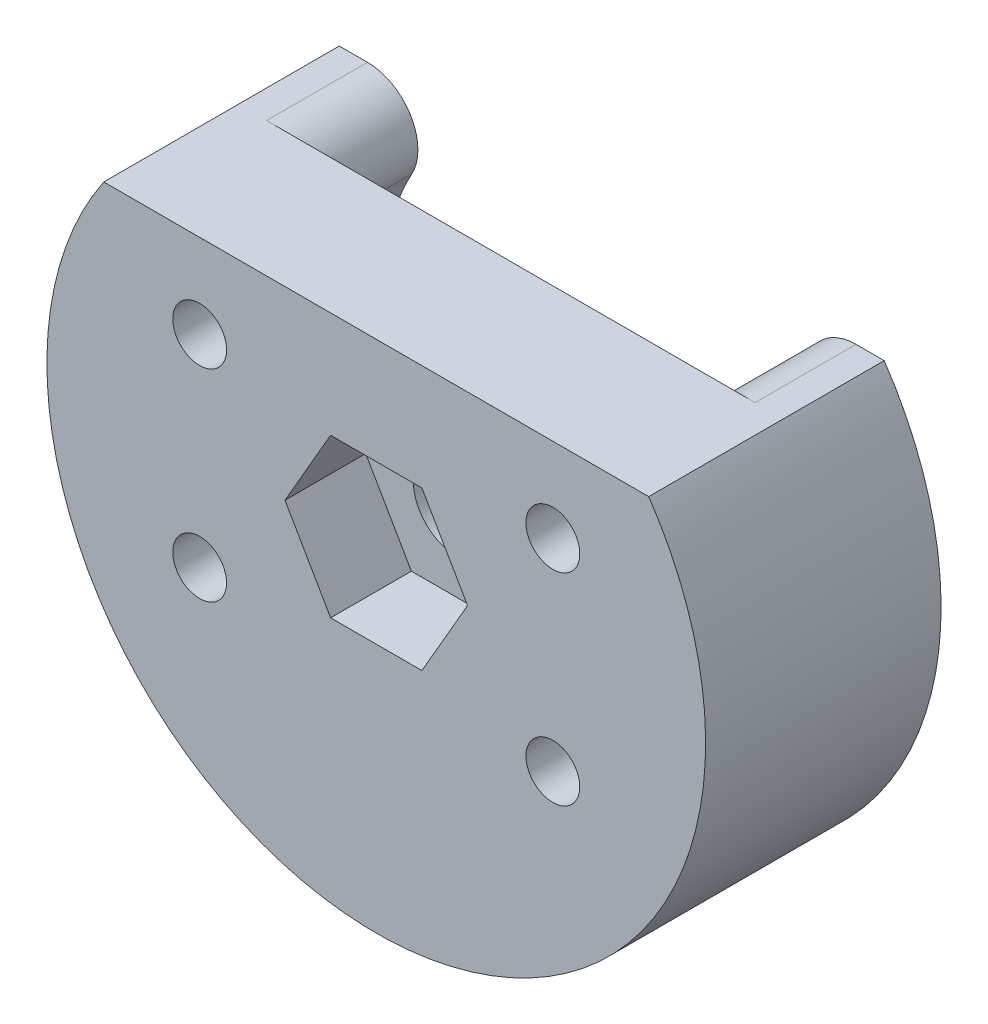
ISO-10303-21;
HEADER;
FILE_DESCRIPTION(('STEP AP214'),'2;1');
FILE_NAME('part.step','',(''),(''),'','','');
FILE_SCHEMA(('AUTOMOTIVE_DESIGN { 1 0 10303 214 1 1 1 1 }'));
ENDSEC;
DATA;
#1=APPLICATION_CONTEXT('core data for automotive mechanical design processes');
#2=APPLICATION_PROTOCOL_DEFINITION('international standard','automotive_design',2000,#1);
#3=PRODUCT_CONTEXT('',#1,'mechanical');
#4=PRODUCT('Part','Part','',(#3));
#5=PRODUCT_RELATED_PRODUCT_CATEGORY('part','',(#4));
#6=PRODUCT_DEFINITION_FORMATION('','',#4);
#7=PRODUCT_DEFINITION_CONTEXT('part definition',#1,'design');
#8=PRODUCT_DEFINITION('design','',#6,#7);
#9=PRODUCT_DEFINITION_SHAPE('','',#8);
#10=(LENGTH_UNIT() NAMED_UNIT(*) SI_UNIT(.MILLI.,.METRE.));
#11=(NAMED_UNIT(*) PLANE_ANGLE_UNIT() SI_UNIT($,.RADIAN.));
#12=(NAMED_UNIT(*) SI_UNIT($,.STERADIAN.) SOLID_ANGLE_UNIT());
#13=UNCERTAINTY_MEASURE_WITH_UNIT(LENGTH_MEASURE(1.E-05),#10,'distance_accuracy_value','');
#14=(GEOMETRIC_REPRESENTATION_CONTEXT(3) GLOBAL_UNCERTAINTY_ASSIGNED_CONTEXT((#13)) GLOBAL_UNIT_ASSIGNED_CONTEXT((#10,
#11,#12)) REPRESENTATION_CONTEXT('',''));
#15=CARTESIAN_POINT('',(0.,0.,0.));
#16=DIRECTION('',(0.,0.,1.));
#17=DIRECTION('',(1.,0.,0.));
#18=AXIS2_PLACEMENT_3D('',#15,#16,#17);
#19=CARTESIAN_POINT('',(8.1,7.,4.));
#20=DIRECTION('',(0.,0.,1.));
#21=DIRECTION('',(1.,0.,0.));
#22=AXIS2_PLACEMENT_3D('',#19,#20,#21);
#23=PLANE('',#22);
#24=DIRECTION('',(0.499999999999999,0.866025403784439,0.));
#25=VECTOR('',#24,1.);
#26=CARTESIAN_POINT('',(9.45677313259562,4.65,4.));
#27=LINE('',#26,#25);
#28=CARTESIAN_POINT('',(9.45677313259562,4.65,4.));
#29=VERTEX_POINT('',#28);
#30=CARTESIAN_POINT('',(10.8135462651912,7.,4.));
#31=VERTEX_POINT('',#30);
#32=EDGE_CURVE('E61',#29,#31,#27,.T.);
#33=ORIENTED_EDGE('',*,*,#32,.F.);
#34=DIRECTION('',(1.,0.,0.));
#35=VECTOR('',#34,1.);
#36=CARTESIAN_POINT('',(6.74322686740437,4.65,4.));
#37=LINE('',#36,#35);
#38=CARTESIAN_POINT('',(6.74322686740437,4.65,4.));
#39=VERTEX_POINT('',#38);
#40=EDGE_CURVE('E211',#39,#29,#37,.T.);
#41=ORIENTED_EDGE('',*,*,#40,.F.);
#42=DIRECTION('',(0.5,-0.866025403784439,0.));
#43=VECTOR('',#42,1.);
#44=CARTESIAN_POINT('',(5.38645373480875,7.,4.));
#45=LINE('',#44,#43);
#46=CARTESIAN_POINT('',(5.38645373480875,7.,4.));
#47=VERTEX_POINT('',#46);
#48=EDGE_CURVE('E237',#47,#39,#45,.T.);
#49=ORIENTED_EDGE('',*,*,#48,.F.);
#50=DIRECTION('',(-0.499999999999999,-0.866025403784439,0.));
#51=VECTOR('',#50,1.);
#52=CARTESIAN_POINT('',(6.74322686740437,9.35000000000001,4.));
#53=LINE('',#52,#51);
#54=CARTESIAN_POINT('',(6.74322686740437,9.35000000000001,4.));
#55=VERTEX_POINT('',#54);
#56=EDGE_CURVE('E234',#55,#47,#53,.T.);
#57=ORIENTED_EDGE('',*,*,#56,.F.);
#58=DIRECTION('',(-1.,0.,0.));
#59=VECTOR('',#58,1.);
#60=CARTESIAN_POINT('',(9.45677313259562,9.35000000000001,4.));
#61=LINE('',#60,#59);
#62=CARTESIAN_POINT('',(9.45677313259562,9.35000000000001,4.));
#63=VERTEX_POINT('',#62);
#64=EDGE_CURVE('E231',#63,#55,#61,.T.);
#65=ORIENTED_EDGE('',*,*,#64,.F.);
#66=DIRECTION('',(-0.5,0.866025403784439,0.));
#67=VECTOR('',#66,1.);
#68=CARTESIAN_POINT('',(10.8135462651912,7.,4.));
#69=LINE('',#68,#67);
#70=EDGE_CURVE('E228',#31,#63,#69,.T.);
#71=ORIENTED_EDGE('',*,*,#70,.F.);
#72=EDGE_LOOP('',(#33,#41,#49,#57,#65,#71));
#73=FACE_BOUND('',#72,.T.);
#74=CARTESIAN_POINT('',(13.35,9.99999999999999,4.));
#75=DIRECTION('',(0.,0.,1.));
#76=DIRECTION('',(-1.,0.,0.));
#77=AXIS2_PLACEMENT_3D('',#74,#75,#76);
#78=CIRCLE('',#77,0.800000000000001);
#79=CARTESIAN_POINT('',(12.55,9.99999999999999,4.));
#80=VERTEX_POINT('',#79);
#81=EDGE_CURVE('E260',#80,#80,#78,.T.);
#82=ORIENTED_EDGE('',*,*,#81,.F.);
#83=EDGE_LOOP('',(#82));
#84=FACE_BOUND('',#83,.T.);
#85=CARTESIAN_POINT('',(2.85,10.,4.));
#86=DIRECTION('',(0.,0.,1.));
#87=DIRECTION('',(1.,0.,0.));
#88=AXIS2_PLACEMENT_3D('',#85,#86,#87);
#89=CIRCLE('',#88,0.8);
#90=CARTESIAN_POINT('',(3.65,10.,4.));
#91=VERTEX_POINT('',#90);
#92=EDGE_CURVE('E272',#91,#91,#89,.T.);
#93=ORIENTED_EDGE('',*,*,#92,.F.);
#94=EDGE_LOOP('',(#93));
#95=FACE_BOUND('',#94,.T.);
#96=CARTESIAN_POINT('',(8.1,7.,4.));
#97=DIRECTION('',(0.,0.,1.));
#98=DIRECTION('',(1.,0.,0.));
#99=AXIS2_PLACEMENT_3D('',#96,#97,#98);
#100=CIRCLE('',#99,9.79081201943945);
#101=CARTESIAN_POINT('',(0.,12.5,4.));
#102=VERTEX_POINT('',#101);
#103=CARTESIAN_POINT('',(16.2,12.5,4.));
#104=VERTEX_POINT('',#103);
#105=EDGE_CURVE('E278',#102,#104,#100,.T.);
#106=ORIENTED_EDGE('',*,*,#105,.T.);
#107=DIRECTION('',(-1.,0.,0.));
#108=VECTOR('',#107,1.);
#109=CARTESIAN_POINT('',(0.,12.5,4.));
#110=LINE('',#109,#108);
#111=EDGE_CURVE('E156',#104,#102,#110,.T.);
#112=ORIENTED_EDGE('',*,*,#111,.T.);
#113=EDGE_LOOP('',(#106,#112));
#114=FACE_BOUND('',#113,.T.);
#115=CARTESIAN_POINT('',(2.85,4.,4.));
#116=DIRECTION('',(0.,0.,1.));
#117=DIRECTION('',(1.,0.,0.));
#118=AXIS2_PLACEMENT_3D('',#115,#116,#117);
#119=CIRCLE('',#118,0.8);
#120=CARTESIAN_POINT('',(3.65,4.,4.));
#121=VERTEX_POINT('',#120);
#122=EDGE_CURVE('E266',#121,#121,#119,.T.);
#123=ORIENTED_EDGE('',*,*,#122,.F.);
#124=EDGE_LOOP('',(#123));
#125=FACE_BOUND('',#124,.T.);
#126=CARTESIAN_POINT('',(13.35,4.,4.));
#127=DIRECTION('',(0.,0.,1.));
#128=DIRECTION('',(-1.,0.,0.));
#129=AXIS2_PLACEMENT_3D('',#126,#127,#128);
#130=CIRCLE('',#129,0.800000000000001);
#131=CARTESIAN_POINT('',(12.55,4.,4.));
#132=VERTEX_POINT('',#131);
#133=EDGE_CURVE('E254',#132,#132,#130,.T.);
#134=ORIENTED_EDGE('',*,*,#133,.F.);
#135=EDGE_LOOP('',(#134));
#136=FACE_BOUND('',#135,.T.);
#137=ADVANCED_FACE('F35',(#73,#84,#95,#114,#125,#136),#23,.T.);
#138=CARTESIAN_POINT('',(8.1,7.,0.));
#139=DIRECTION('',(0.,0.,1.));
#140=DIRECTION('',(1.,0.,0.));
#141=AXIS2_PLACEMENT_3D('',#138,#139,#140);
#142=PLANE('',#141);
#143=CARTESIAN_POINT('',(8.1,7.,0.));
#144=DIRECTION('',(0.,0.,1.));
#145=DIRECTION('',(1.,0.,0.));
#146=AXIS2_PLACEMENT_3D('',#143,#144,#145);
#147=CIRCLE('',#146,1.3);
#148=CARTESIAN_POINT('',(9.4,7.,0.));
#149=VERTEX_POINT('',#148);
#150=EDGE_CURVE('E197',#149,#149,#147,.F.);
#151=ORIENTED_EDGE('',*,*,#150,.F.);
#152=EDGE_LOOP('',(#151));
#153=FACE_BOUND('',#152,.T.);
#154=DIRECTION('',(-1.,0.,0.));
#155=VECTOR('',#154,1.);
#156=CARTESIAN_POINT('',(0.,12.5,0.));
#157=LINE('',#156,#155);
#158=CARTESIAN_POINT('',(15.36206333914,12.5,0.));
#159=VERTEX_POINT('',#158);
#160=CARTESIAN_POINT('',(0.837936660859968,12.5,0.));
#161=VERTEX_POINT('',#160);
#162=EDGE_CURVE('E275',#159,#161,#157,.T.);
#163=ORIENTED_EDGE('',*,*,#162,.F.);
#164=CARTESIAN_POINT('',(15.36206333914,11.,0.));
#165=DIRECTION('',(0.,0.,1.));
#166=DIRECTION('',(1.,0.,0.));
#167=AXIS2_PLACEMENT_3D('',#164,#165,#166);
#168=CIRCLE('',#167,1.5);
#169=CARTESIAN_POINT('',(13.9312576676579,10.5496721966671,0.));
#170=VERTEX_POINT('',#169);
#171=EDGE_CURVE('E189',#159,#170,#168,.T.);
#172=ORIENTED_EDGE('',*,*,#171,.T.);
#173=CARTESIAN_POINT('',(13.35,9.99999999999999,0.));
#174=DIRECTION('',(0.,0.,1.));
#175=DIRECTION('',(-1.,0.,0.));
#176=AXIS2_PLACEMENT_3D('',#173,#174,#175);
#177=CIRCLE('',#176,0.800000000000001);
#178=CARTESIAN_POINT('',(14.1442871458399,10.0954354753407,0.));
#179=VERTEX_POINT('',#178);
#180=EDGE_CURVE('E257',#170,#179,#177,.T.);
#181=ORIENTED_EDGE('',*,*,#180,.T.);
#182=CARTESIAN_POINT('',(8.1,7.,0.));
#183=DIRECTION('',(0.,0.,-1.));
#184=DIRECTION('',(1.,0.,0.));
#185=AXIS2_PLACEMENT_3D('',#182,#183,#184);
#186=CIRCLE('',#185,6.79081201943945);
#187=CARTESIAN_POINT('',(14.1442871458399,3.90456452465927,0.));
#188=VERTEX_POINT('',#187);
#189=EDGE_CURVE('E11',#179,#188,#186,.T.);
#190=ORIENTED_EDGE('',*,*,#189,.T.);
#191=CARTESIAN_POINT('',(13.35,4.,0.));
#192=DIRECTION('',(0.,0.,1.));
#193=DIRECTION('',(-1.,0.,0.));
#194=AXIS2_PLACEMENT_3D('',#191,#192,#193);
#195=CIRCLE('',#194,0.800000000000001);
#196=CARTESIAN_POINT('',(13.835474806643,3.36414293106476,0.));
#197=VERTEX_POINT('',#196);
#198=EDGE_CURVE('E244',#188,#197,#195,.T.);
#199=ORIENTED_EDGE('',*,*,#198,.T.);
#200=CARTESIAN_POINT('',(2.36452519335695,3.36414293106478,0.));
#201=VERTEX_POINT('',#200);
#202=EDGE_CURVE('E44',#197,#201,#186,.T.);
#203=ORIENTED_EDGE('',*,*,#202,.T.);
#204=CARTESIAN_POINT('',(2.85,4.,0.));
#205=DIRECTION('',(0.,0.,1.));
#206=DIRECTION('',(1.,0.,0.));
#207=AXIS2_PLACEMENT_3D('',#204,#205,#206);
#208=CIRCLE('',#207,0.8);
#209=CARTESIAN_POINT('',(2.05571285416011,3.90456452465926,0.));
#210=VERTEX_POINT('',#209);
#211=EDGE_CURVE('E263',#201,#210,#208,.T.);
#212=ORIENTED_EDGE('',*,*,#211,.T.);
#213=CARTESIAN_POINT('',(2.0557128541601,10.0954354753407,0.));
#214=VERTEX_POINT('',#213);
#215=EDGE_CURVE('E194',#210,#214,#186,.T.);
#216=ORIENTED_EDGE('',*,*,#215,.T.);
#217=CARTESIAN_POINT('',(2.85,10.,0.));
#218=DIRECTION('',(0.,0.,1.));
#219=DIRECTION('',(1.,0.,0.));
#220=AXIS2_PLACEMENT_3D('',#217,#218,#219);
#221=CIRCLE('',#220,0.8);
#222=CARTESIAN_POINT('',(2.26874233234209,10.5496721966672,0.));
#223=VERTEX_POINT('',#222);
#224=EDGE_CURVE('E269',#214,#223,#221,.T.);
#225=ORIENTED_EDGE('',*,*,#224,.T.);
#226=CARTESIAN_POINT('',(0.837936660859968,11.,0.));
#227=DIRECTION('',(0.,0.,1.));
#228=DIRECTION('',(-1.,0.,0.));
#229=AXIS2_PLACEMENT_3D('',#226,#227,#228);
#230=CIRCLE('',#229,1.5);
#231=EDGE_CURVE('E161',#223,#161,#230,.T.);
#232=ORIENTED_EDGE('',*,*,#231,.T.);
#233=EDGE_LOOP('',(#163,#172,#181,#190,#199,#203,#212,#216,#225,#232));
#234=FACE_BOUND('',#233,.T.);
#235=ADVANCED_FACE('F286',(#153,#234),#142,.F.);
#236=CARTESIAN_POINT('',(8.1,7.,4.));
#237=DIRECTION('',(0.,0.,-1.));
#238=DIRECTION('',(-1.,0.,0.));
#239=AXIS2_PLACEMENT_3D('',#236,#237,#238);
#240=CYLINDRICAL_SURFACE('',#239,9.79081201943945);
#241=DIRECTION('',(0.,0.,-1.));
#242=VECTOR('',#241,1.);
#243=CARTESIAN_POINT('',(0.,12.5,4.));
#244=LINE('',#243,#242);
#245=CARTESIAN_POINT('',(0.,12.5,-3.));
#246=VERTEX_POINT('',#245);
#247=EDGE_CURVE('E162',#102,#246,#244,.T.);
#248=ORIENTED_EDGE('',*,*,#247,.T.);
#249=CARTESIAN_POINT('',(8.1,7.,-3.));
#250=DIRECTION('',(0.,0.,1.));
#251=DIRECTION('',(1.,0.,0.));
#252=AXIS2_PLACEMENT_3D('',#249,#250,#251);
#253=CIRCLE('',#252,9.79081201943945);
#254=CARTESIAN_POINT('',(16.2,12.5,-3.));
#255=VERTEX_POINT('',#254);
#256=EDGE_CURVE('E168',#246,#255,#253,.T.);
#257=ORIENTED_EDGE('',*,*,#256,.T.);
#258=DIRECTION('',(0.,0.,-1.));
#259=VECTOR('',#258,1.);
#260=CARTESIAN_POINT('',(16.2,12.5,4.));
#261=LINE('',#260,#259);
#262=EDGE_CURVE('E151',#104,#255,#261,.T.);
#263=ORIENTED_EDGE('',*,*,#262,.F.);
#264=ORIENTED_EDGE('',*,*,#105,.F.);
#265=EDGE_LOOP('',(#248,#257,#263,#264));
#266=FACE_BOUND('',#265,.T.);
#267=ADVANCED_FACE('F37',(#266),#240,.T.);
#268=CARTESIAN_POINT('',(0.,12.5,4.));
#269=DIRECTION('',(0.,-1.,0.));
#270=DIRECTION('',(0.,0.,-1.));
#271=AXIS2_PLACEMENT_3D('',#268,#269,#270);
#272=PLANE('',#271);
#273=ORIENTED_EDGE('',*,*,#262,.T.);
#274=DIRECTION('',(-1.,0.,0.));
#275=VECTOR('',#274,1.);
#276=CARTESIAN_POINT('',(16.2,12.5,-3.));
#277=LINE('',#276,#275);
#278=CARTESIAN_POINT('',(15.36206333914,12.5,-3.));
#279=VERTEX_POINT('',#278);
#280=EDGE_CURVE('E154',#255,#279,#277,.T.);
#281=ORIENTED_EDGE('',*,*,#280,.T.);
#282=DIRECTION('',(0.,0.,1.));
#283=VECTOR('',#282,1.);
#284=CARTESIAN_POINT('',(15.36206333914,12.5,-3.));
#285=LINE('',#284,#283);
#286=EDGE_CURVE('E188',#279,#159,#285,.T.);
#287=ORIENTED_EDGE('',*,*,#286,.T.);
#288=ORIENTED_EDGE('',*,*,#162,.T.);
#289=DIRECTION('',(0.,0.,1.));
#290=VECTOR('',#289,1.);
#291=CARTESIAN_POINT('',(0.837936660859984,12.5,-3.));
#292=LINE('',#291,#290);
#293=CARTESIAN_POINT('',(0.837936660859984,12.5,-3.));
#294=VERTEX_POINT('',#293);
#295=EDGE_CURVE('E53',#294,#161,#292,.T.);
#296=ORIENTED_EDGE('',*,*,#295,.F.);
#297=DIRECTION('',(-1.,0.,0.));
#298=VECTOR('',#297,1.);
#299=CARTESIAN_POINT('',(0.,12.5,-3.));
#300=LINE('',#299,#298);
#301=EDGE_CURVE('E186',#294,#246,#300,.T.);
#302=ORIENTED_EDGE('',*,*,#301,.T.);
#303=ORIENTED_EDGE('',*,*,#247,.F.);
#304=ORIENTED_EDGE('',*,*,#111,.F.);
#305=EDGE_LOOP('',(#273,#281,#287,#288,#296,#302,#303,#304));
#306=FACE_BOUND('',#305,.T.);
#307=ADVANCED_FACE('F153',(#306),#272,.F.);
#308=CARTESIAN_POINT('',(2.85,10.,4.));
#309=DIRECTION('',(0.,0.,-1.));
#310=DIRECTION('',(-1.,0.,0.));
#311=AXIS2_PLACEMENT_3D('',#308,#309,#310);
#312=CYLINDRICAL_SURFACE('',#311,0.8);
#313=ORIENTED_EDGE('',*,*,#92,.T.);
#314=EDGE_LOOP('',(#313));
#315=FACE_BOUND('',#314,.T.);
#316=EDGE_CURVE('E276',#223,#214,#221,.T.);
#317=ORIENTED_EDGE('',*,*,#316,.F.);
#318=ORIENTED_EDGE('',*,*,#224,.F.);
#319=EDGE_LOOP('',(#317,#318));
#320=FACE_BOUND('',#319,.T.);
#321=ADVANCED_FACE('F340',(#315,#320),#312,.F.);
#322=CARTESIAN_POINT('',(2.85,4.,4.));
#323=DIRECTION('',(0.,0.,-1.));
#324=DIRECTION('',(-1.,0.,0.));
#325=AXIS2_PLACEMENT_3D('',#322,#323,#324);
#326=CYLINDRICAL_SURFACE('',#325,0.8);
#327=ORIENTED_EDGE('',*,*,#122,.T.);
#328=EDGE_LOOP('',(#327));
#329=FACE_BOUND('',#328,.T.);
#330=EDGE_CURVE('E270',#210,#201,#208,.T.);
#331=ORIENTED_EDGE('',*,*,#330,.F.);
#332=ORIENTED_EDGE('',*,*,#211,.F.);
#333=EDGE_LOOP('',(#331,#332));
#334=FACE_BOUND('',#333,.T.);
#335=ADVANCED_FACE('F306',(#329,#334),#326,.F.);
#336=CARTESIAN_POINT('',(13.35,9.99999999999999,4.));
#337=DIRECTION('',(0.,0.,-1.));
#338=DIRECTION('',(-1.,0.,0.));
#339=AXIS2_PLACEMENT_3D('',#336,#337,#338);
#340=CYLINDRICAL_SURFACE('',#339,0.800000000000001);
#341=ORIENTED_EDGE('',*,*,#81,.T.);
#342=EDGE_LOOP('',(#341));
#343=FACE_BOUND('',#342,.T.);
#344=EDGE_CURVE('E264',#179,#170,#177,.T.);
#345=ORIENTED_EDGE('',*,*,#344,.F.);
#346=ORIENTED_EDGE('',*,*,#180,.F.);
#347=EDGE_LOOP('',(#345,#346));
#348=FACE_BOUND('',#347,.T.);
#349=ADVANCED_FACE('F449',(#343,#348),#340,.F.);
#350=CARTESIAN_POINT('',(13.35,4.,4.));
#351=DIRECTION('',(0.,0.,-1.));
#352=DIRECTION('',(-1.,0.,0.));
#353=AXIS2_PLACEMENT_3D('',#350,#351,#352);
#354=CYLINDRICAL_SURFACE('',#353,0.800000000000001);
#355=ORIENTED_EDGE('',*,*,#133,.T.);
#356=EDGE_LOOP('',(#355));
#357=FACE_BOUND('',#356,.T.);
#358=EDGE_CURVE('E258',#197,#188,#195,.T.);
#359=ORIENTED_EDGE('',*,*,#358,.F.);
#360=ORIENTED_EDGE('',*,*,#198,.F.);
#361=EDGE_LOOP('',(#359,#360));
#362=FACE_BOUND('',#361,.T.);
#363=ADVANCED_FACE('F436',(#357,#362),#354,.F.);
#364=CARTESIAN_POINT('',(9.45677313259562,4.65,1.6));
#365=DIRECTION('',(0.866025403784439,-0.499999999999999,0.));
#366=DIRECTION('',(0.499999999999999,0.866025403784439,0.));
#367=AXIS2_PLACEMENT_3D('',#364,#365,#366);
#368=PLANE('',#367);
#369=ORIENTED_EDGE('',*,*,#32,.T.);
#370=DIRECTION('',(0.,0.,1.));
#371=VECTOR('',#370,1.);
#372=CARTESIAN_POINT('',(10.8135462651912,7.,1.6));
#373=LINE('',#372,#371);
#374=CARTESIAN_POINT('',(10.8135462651912,7.,1.6));
#375=VERTEX_POINT('',#374);
#376=EDGE_CURVE('E226',#375,#31,#373,.T.);
#377=ORIENTED_EDGE('',*,*,#376,.F.);
#378=DIRECTION('',(0.499999999999999,0.866025403784439,0.));
#379=VECTOR('',#378,1.);
#380=CARTESIAN_POINT('',(9.45677313259562,4.65,1.6));
#381=LINE('',#380,#379);
#382=CARTESIAN_POINT('',(9.45677313259562,4.65,1.6));
#383=VERTEX_POINT('',#382);
#384=EDGE_CURVE('E207',#383,#375,#381,.T.);
#385=ORIENTED_EDGE('',*,*,#384,.F.);
#386=DIRECTION('',(0.,0.,1.));
#387=VECTOR('',#386,1.);
#388=CARTESIAN_POINT('',(9.45677313259562,4.65,1.6));
#389=LINE('',#388,#387);
#390=EDGE_CURVE('E242',#383,#29,#389,.T.);
#391=ORIENTED_EDGE('',*,*,#390,.T.);
#392=EDGE_LOOP('',(#369,#377,#385,#391));
#393=FACE_BOUND('',#392,.T.);
#394=ADVANCED_FACE('F427',(#393),#368,.F.);
#395=CARTESIAN_POINT('',(6.74322686740437,4.65,1.6));
#396=DIRECTION('',(0.,-1.,0.));
#397=DIRECTION('',(0.,0.,-1.));
#398=AXIS2_PLACEMENT_3D('',#395,#396,#397);
#399=PLANE('',#398);
#400=ORIENTED_EDGE('',*,*,#40,.T.);
#401=ORIENTED_EDGE('',*,*,#390,.F.);
#402=DIRECTION('',(1.,0.,0.));
#403=VECTOR('',#402,1.);
#404=CARTESIAN_POINT('',(6.74322686740437,4.65,1.6));
#405=LINE('',#404,#403);
#406=CARTESIAN_POINT('',(6.74322686740437,4.65,1.6));
#407=VERTEX_POINT('',#406);
#408=EDGE_CURVE('E223',#407,#383,#405,.T.);
#409=ORIENTED_EDGE('',*,*,#408,.F.);
#410=DIRECTION('',(0.,0.,1.));
#411=VECTOR('',#410,1.);
#412=CARTESIAN_POINT('',(6.74322686740437,4.65,1.6));
#413=LINE('',#412,#411);
#414=EDGE_CURVE('E245',#407,#39,#413,.T.);
#415=ORIENTED_EDGE('',*,*,#414,.T.);
#416=EDGE_LOOP('',(#400,#401,#409,#415));
#417=FACE_BOUND('',#416,.T.);
#418=ADVANCED_FACE('F417',(#417),#399,.F.);
#419=CARTESIAN_POINT('',(5.38645373480875,7.,1.6));
#420=DIRECTION('',(-0.866025403784439,-0.5,0.));
#421=DIRECTION('',(0.5,-0.866025403784439,0.));
#422=AXIS2_PLACEMENT_3D('',#419,#420,#421);
#423=PLANE('',#422);
#424=ORIENTED_EDGE('',*,*,#48,.T.);
#425=ORIENTED_EDGE('',*,*,#414,.F.);
#426=DIRECTION('',(0.5,-0.866025403784439,0.));
#427=VECTOR('',#426,1.);
#428=CARTESIAN_POINT('',(5.38645373480875,7.,1.6));
#429=LINE('',#428,#427);
#430=CARTESIAN_POINT('',(5.38645373480875,7.,1.6));
#431=VERTEX_POINT('',#430);
#432=EDGE_CURVE('E220',#431,#407,#429,.T.);
#433=ORIENTED_EDGE('',*,*,#432,.F.);
#434=DIRECTION('',(0.,0.,1.));
#435=VECTOR('',#434,1.);
#436=CARTESIAN_POINT('',(5.38645373480875,7.,1.6));
#437=LINE('',#436,#435);
#438=EDGE_CURVE('E247',#431,#47,#437,.T.);
#439=ORIENTED_EDGE('',*,*,#438,.T.);
#440=EDGE_LOOP('',(#424,#425,#433,#439));
#441=FACE_BOUND('',#440,.T.);
#442=ADVANCED_FACE('F407',(#441),#423,.F.);
#443=CARTESIAN_POINT('',(6.74322686740437,9.35000000000001,1.6));
#444=DIRECTION('',(-0.866025403784439,0.499999999999999,0.));
#445=DIRECTION('',(-0.499999999999999,-0.866025403784439,0.));
#446=AXIS2_PLACEMENT_3D('',#443,#444,#445);
#447=PLANE('',#446);
#448=ORIENTED_EDGE('',*,*,#56,.T.);
#449=ORIENTED_EDGE('',*,*,#438,.F.);
#450=DIRECTION('',(-0.499999999999999,-0.866025403784439,0.));
#451=VECTOR('',#450,1.);
#452=CARTESIAN_POINT('',(6.74322686740437,9.35000000000001,1.6));
#453=LINE('',#452,#451);
#454=CARTESIAN_POINT('',(6.74322686740437,9.35000000000001,1.6));
#455=VERTEX_POINT('',#454);
#456=EDGE_CURVE('E217',#455,#431,#453,.T.);
#457=ORIENTED_EDGE('',*,*,#456,.F.);
#458=DIRECTION('',(0.,0.,1.));
#459=VECTOR('',#458,1.);
#460=CARTESIAN_POINT('',(6.74322686740437,9.35000000000001,1.6));
#461=LINE('',#460,#459);
#462=EDGE_CURVE('E249',#455,#55,#461,.T.);
#463=ORIENTED_EDGE('',*,*,#462,.T.);
#464=EDGE_LOOP('',(#448,#449,#457,#463));
#465=FACE_BOUND('',#464,.T.);
#466=ADVANCED_FACE('F397',(#465),#447,.F.);
#467=CARTESIAN_POINT('',(9.45677313259562,9.35000000000001,1.6));
#468=DIRECTION('',(0.,1.,0.));
#469=DIRECTION('',(0.,0.,1.));
#470=AXIS2_PLACEMENT_3D('',#467,#468,#469);
#471=PLANE('',#470);
#472=ORIENTED_EDGE('',*,*,#64,.T.);
#473=ORIENTED_EDGE('',*,*,#462,.F.);
#474=DIRECTION('',(-1.,0.,0.));
#475=VECTOR('',#474,1.);
#476=CARTESIAN_POINT('',(9.45677313259562,9.35000000000001,1.6));
#477=LINE('',#476,#475);
#478=CARTESIAN_POINT('',(9.45677313259562,9.35000000000001,1.6));
#479=VERTEX_POINT('',#478);
#480=EDGE_CURVE('E214',#479,#455,#477,.T.);
#481=ORIENTED_EDGE('',*,*,#480,.F.);
#482=DIRECTION('',(0.,0.,1.));
#483=VECTOR('',#482,1.);
#484=CARTESIAN_POINT('',(9.45677313259562,9.35000000000001,1.6));
#485=LINE('',#484,#483);
#486=EDGE_CURVE('E251',#479,#63,#485,.T.);
#487=ORIENTED_EDGE('',*,*,#486,.T.);
#488=EDGE_LOOP('',(#472,#473,#481,#487));
#489=FACE_BOUND('',#488,.T.);
#490=ADVANCED_FACE('F387',(#489),#471,.F.);
#491=CARTESIAN_POINT('',(10.8135462651912,7.,1.6));
#492=DIRECTION('',(0.866025403784439,0.5,0.));
#493=DIRECTION('',(-0.5,0.866025403784439,0.));
#494=AXIS2_PLACEMENT_3D('',#491,#492,#493);
#495=PLANE('',#494);
#496=ORIENTED_EDGE('',*,*,#70,.T.);
#497=ORIENTED_EDGE('',*,*,#486,.F.);
#498=DIRECTION('',(-0.5,0.866025403784439,0.));
#499=VECTOR('',#498,1.);
#500=CARTESIAN_POINT('',(10.8135462651912,7.,1.6));
#501=LINE('',#500,#499);
#502=EDGE_CURVE('E210',#375,#479,#501,.T.);
#503=ORIENTED_EDGE('',*,*,#502,.F.);
#504=ORIENTED_EDGE('',*,*,#376,.T.);
#505=EDGE_LOOP('',(#496,#497,#503,#504));
#506=FACE_BOUND('',#505,.T.);
#507=ADVANCED_FACE('F377',(#506),#495,.F.);
#508=CARTESIAN_POINT('',(0.,0.,1.6));
#509=DIRECTION('',(0.,0.,1.));
#510=DIRECTION('',(1.,0.,0.));
#511=AXIS2_PLACEMENT_3D('',#508,#509,#510);
#512=PLANE('',#511);
#513=CARTESIAN_POINT('',(8.1,7.,1.6));
#514=DIRECTION('',(0.,0.,1.));
#515=DIRECTION('',(1.,0.,0.));
#516=AXIS2_PLACEMENT_3D('',#513,#514,#515);
#517=CIRCLE('',#516,1.3);
#518=CARTESIAN_POINT('',(9.4,7.,1.6));
#519=VERTEX_POINT('',#518);
#520=EDGE_CURVE('E39',#519,#519,#517,.T.);
#521=ORIENTED_EDGE('',*,*,#520,.F.);
#522=EDGE_LOOP('',(#521));
#523=FACE_BOUND('',#522,.T.);
#524=ORIENTED_EDGE('',*,*,#384,.T.);
#525=ORIENTED_EDGE('',*,*,#502,.T.);
#526=ORIENTED_EDGE('',*,*,#480,.T.);
#527=ORIENTED_EDGE('',*,*,#456,.T.);
#528=ORIENTED_EDGE('',*,*,#432,.T.);
#529=ORIENTED_EDGE('',*,*,#408,.T.);
#530=EDGE_LOOP('',(#524,#525,#526,#527,#528,#529));
#531=FACE_BOUND('',#530,.T.);
#532=ADVANCED_FACE('F366',(#523,#531),#512,.T.);
#533=CARTESIAN_POINT('',(8.1,7.,-3.67695526217005));
#534=DIRECTION('',(0.,0.,1.));
#535=DIRECTION('',(1.,0.,0.));
#536=AXIS2_PLACEMENT_3D('',#533,#534,#535);
#537=CYLINDRICAL_SURFACE('',#536,1.3);
#538=ORIENTED_EDGE('',*,*,#520,.T.);
#539=EDGE_LOOP('',(#538));
#540=FACE_BOUND('',#539,.T.);
#541=ORIENTED_EDGE('',*,*,#150,.T.);
#542=EDGE_LOOP('',(#541));
#543=FACE_BOUND('',#542,.T.);
#544=ADVANCED_FACE('F361',(#540,#543),#537,.F.);
#545=CARTESIAN_POINT('',(8.1,7.,0.));
#546=DIRECTION('',(0.,0.,1.));
#547=DIRECTION('',(1.,0.,0.));
#548=AXIS2_PLACEMENT_3D('',#545,#546,#547);
#549=PLANE('',#548);
#550=CARTESIAN_POINT('',(2.15181218754771,10.2763073163483,0.));
#551=VERTEX_POINT('',#550);
#552=EDGE_CURVE('E174',#551,#223,#230,.T.);
#553=ORIENTED_EDGE('',*,*,#552,.T.);
#554=ORIENTED_EDGE('',*,*,#316,.T.);
#555=EDGE_CURVE('E191',#214,#551,#186,.T.);
#556=ORIENTED_EDGE('',*,*,#555,.T.);
#557=EDGE_LOOP('',(#553,#554,#556));
#558=FACE_BOUND('',#557,.T.);
#559=ADVANCED_FACE('F315',(#558),#549,.T.);
#560=EDGE_CURVE('E310',#201,#210,#186,.T.);
#561=ORIENTED_EDGE('',*,*,#560,.T.);
#562=ORIENTED_EDGE('',*,*,#330,.T.);
#563=EDGE_LOOP('',(#561,#562));
#564=FACE_BOUND('',#563,.T.);
#565=ADVANCED_FACE('F309',(#564),#549,.T.);
#566=CARTESIAN_POINT('',(14.0481878124523,10.2763073163483,0.));
#567=VERTEX_POINT('',#566);
#568=EDGE_CURVE('E177',#567,#179,#186,.T.);
#569=ORIENTED_EDGE('',*,*,#568,.T.);
#570=ORIENTED_EDGE('',*,*,#344,.T.);
#571=EDGE_CURVE('E192',#170,#567,#168,.T.);
#572=ORIENTED_EDGE('',*,*,#571,.T.);
#573=EDGE_LOOP('',(#569,#570,#572));
#574=FACE_BOUND('',#573,.T.);
#575=ADVANCED_FACE('F319',(#574),#549,.T.);
#576=CARTESIAN_POINT('',(0.837936660859968,11.,-3.));
#577=DIRECTION('',(0.,0.,1.));
#578=DIRECTION('',(1.,0.,0.));
#579=AXIS2_PLACEMENT_3D('',#576,#577,#578);
#580=CYLINDRICAL_SURFACE('',#579,1.5);
#581=ORIENTED_EDGE('',*,*,#552,.F.);
#582=DIRECTION('',(0.,0.,1.));
#583=VECTOR('',#582,1.);
#584=CARTESIAN_POINT('',(2.15181218754771,10.2763073163483,-3.));
#585=LINE('',#584,#583);
#586=CARTESIAN_POINT('',(2.15181218754771,10.2763073163483,-3.));
#587=VERTEX_POINT('',#586);
#588=EDGE_CURVE('E198',#587,#551,#585,.T.);
#589=ORIENTED_EDGE('',*,*,#588,.F.);
#590=CARTESIAN_POINT('',(0.837936660859968,11.,-3.));
#591=DIRECTION('',(0.,0.,1.));
#592=DIRECTION('',(-1.,0.,0.));
#593=AXIS2_PLACEMENT_3D('',#590,#591,#592);
#594=CIRCLE('',#593,1.5);
#595=EDGE_CURVE('E184',#587,#294,#594,.T.);
#596=ORIENTED_EDGE('',*,*,#595,.T.);
#597=ORIENTED_EDGE('',*,*,#295,.T.);
#598=ORIENTED_EDGE('',*,*,#231,.F.);
#599=EDGE_LOOP('',(#581,#589,#596,#597,#598));
#600=FACE_BOUND('',#599,.T.);
#601=ADVANCED_FACE('F317',(#600),#580,.T.);
#602=CARTESIAN_POINT('',(8.1,7.,-3.));
#603=DIRECTION('',(0.,0.,1.));
#604=DIRECTION('',(1.,0.,0.));
#605=AXIS2_PLACEMENT_3D('',#602,#603,#604);
#606=CYLINDRICAL_SURFACE('',#605,6.79081201943945);
#607=ORIENTED_EDGE('',*,*,#568,.F.);
#608=DIRECTION('',(0.,0.,1.));
#609=VECTOR('',#608,1.);
#610=CARTESIAN_POINT('',(14.0481878124523,10.2763073163483,-3.));
#611=LINE('',#610,#609);
#612=CARTESIAN_POINT('',(14.0481878124523,10.2763073163483,-3.));
#613=VERTEX_POINT('',#612);
#614=EDGE_CURVE('E201',#613,#567,#611,.T.);
#615=ORIENTED_EDGE('',*,*,#614,.F.);
#616=CARTESIAN_POINT('',(8.1,7.,-3.));
#617=DIRECTION('',(0.,0.,-1.));
#618=DIRECTION('',(1.,0.,0.));
#619=AXIS2_PLACEMENT_3D('',#616,#617,#618);
#620=CIRCLE('',#619,6.79081201943945);
#621=EDGE_CURVE('E181',#613,#587,#620,.T.);
#622=ORIENTED_EDGE('',*,*,#621,.T.);
#623=ORIENTED_EDGE('',*,*,#588,.T.);
#624=ORIENTED_EDGE('',*,*,#555,.F.);
#625=ORIENTED_EDGE('',*,*,#215,.F.);
#626=ORIENTED_EDGE('',*,*,#560,.F.);
#627=ORIENTED_EDGE('',*,*,#202,.F.);
#628=EDGE_CURVE('E46',#188,#197,#186,.T.);
#629=ORIENTED_EDGE('',*,*,#628,.F.);
#630=ORIENTED_EDGE('',*,*,#189,.F.);
#631=EDGE_LOOP('',(#607,#615,#622,#623,#624,#625,#626,#627,#629,#630));
#632=FACE_BOUND('',#631,.T.);
#633=ADVANCED_FACE('F312',(#632),#606,.F.);
#634=CARTESIAN_POINT('',(15.36206333914,11.,-3.));
#635=DIRECTION('',(0.,0.,1.));
#636=DIRECTION('',(1.,0.,0.));
#637=AXIS2_PLACEMENT_3D('',#634,#635,#636);
#638=CYLINDRICAL_SURFACE('',#637,1.5);
#639=ORIENTED_EDGE('',*,*,#171,.F.);
#640=ORIENTED_EDGE('',*,*,#286,.F.);
#641=CARTESIAN_POINT('',(15.36206333914,11.,-3.));
#642=DIRECTION('',(0.,0.,1.));
#643=DIRECTION('',(1.,0.,0.));
#644=AXIS2_PLACEMENT_3D('',#641,#642,#643);
#645=CIRCLE('',#644,1.5);
#646=EDGE_CURVE('E172',#279,#613,#645,.T.);
#647=ORIENTED_EDGE('',*,*,#646,.T.);
#648=ORIENTED_EDGE('',*,*,#614,.T.);
#649=ORIENTED_EDGE('',*,*,#571,.F.);
#650=EDGE_LOOP('',(#639,#640,#647,#648,#649));
#651=FACE_BOUND('',#650,.T.);
#652=ADVANCED_FACE('F325',(#651),#638,.T.);
#653=CARTESIAN_POINT('',(8.1,7.,-3.));
#654=DIRECTION('',(0.,0.,1.));
#655=DIRECTION('',(1.,0.,0.));
#656=AXIS2_PLACEMENT_3D('',#653,#654,#655);
#657=PLANE('',#656);
#658=ORIENTED_EDGE('',*,*,#256,.F.);
#659=ORIENTED_EDGE('',*,*,#301,.F.);
#660=ORIENTED_EDGE('',*,*,#595,.F.);
#661=ORIENTED_EDGE('',*,*,#621,.F.);
#662=ORIENTED_EDGE('',*,*,#646,.F.);
#663=ORIENTED_EDGE('',*,*,#280,.F.);
#664=EDGE_LOOP('',(#658,#659,#660,#661,#662,#663));
#665=FACE_BOUND('',#664,.T.);
#666=ADVANCED_FACE('F166',(#665),#657,.F.);
#667=ORIENTED_EDGE('',*,*,#628,.T.);
#668=ORIENTED_EDGE('',*,*,#358,.T.);
#669=EDGE_LOOP('',(#667,#668));
#670=FACE_BOUND('',#669,.T.);
#671=ADVANCED_FACE('F329',(#670),#549,.T.);
#672=CLOSED_SHELL('',(#137,#235,#267,#307,#321,#335,#349,#363,#394,#418,#442,#466,#490,#507,
#532,#544,#559,#565,#575,#601,#633,#652,#666,#671));
#673=MANIFOLD_SOLID_BREP('B2',#672);
#674=ADVANCED_BREP_SHAPE_REPRESENTATION('',(#18,#673),#14);
#675=SHAPE_DEFINITION_REPRESENTATION(#9,#674);
ENDSEC;
END-ISO-10303-21;
